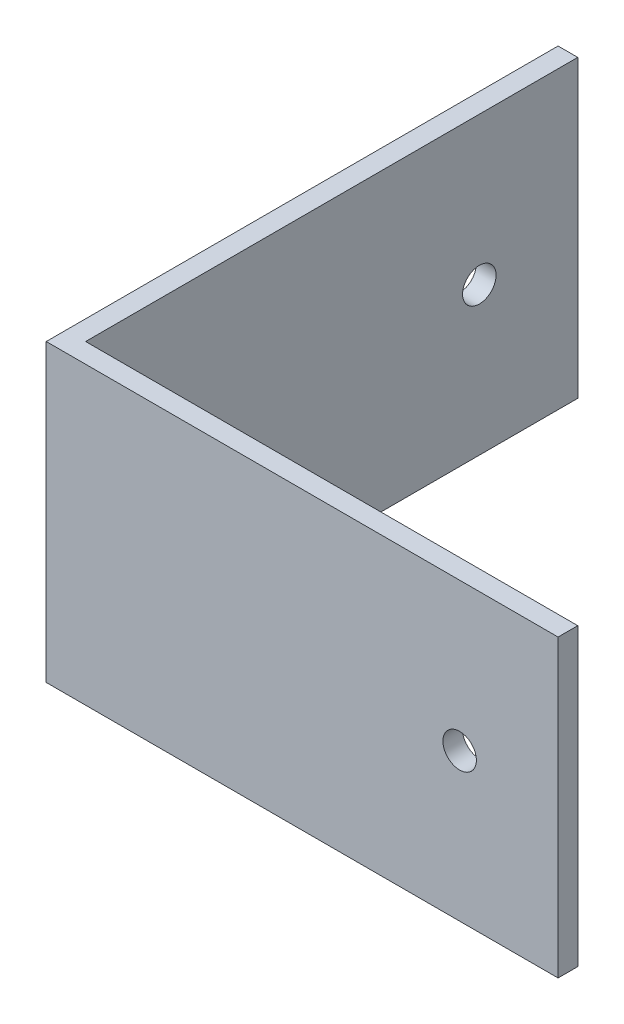
ISO-10303-21;
HEADER;
FILE_DESCRIPTION(('STEP AP214'),'2;1');
FILE_NAME('part.step','',(''),(''),'','','');
FILE_SCHEMA(('AUTOMOTIVE_DESIGN { 1 0 10303 214 1 1 1 1 }'));
ENDSEC;
DATA;
#1=APPLICATION_CONTEXT('core data for automotive mechanical design processes');
#2=APPLICATION_PROTOCOL_DEFINITION('international standard','automotive_design',2000,#1);
#3=PRODUCT_CONTEXT('',#1,'mechanical');
#4=PRODUCT('Part','Part','',(#3));
#5=PRODUCT_RELATED_PRODUCT_CATEGORY('part','',(#4));
#6=PRODUCT_DEFINITION_FORMATION('','',#4);
#7=PRODUCT_DEFINITION_CONTEXT('part definition',#1,'design');
#8=PRODUCT_DEFINITION('design','',#6,#7);
#9=PRODUCT_DEFINITION_SHAPE('','',#8);
#10=(LENGTH_UNIT() NAMED_UNIT(*) SI_UNIT(.MILLI.,.METRE.));
#11=(NAMED_UNIT(*) PLANE_ANGLE_UNIT() SI_UNIT($,.RADIAN.));
#12=(NAMED_UNIT(*) SI_UNIT($,.STERADIAN.) SOLID_ANGLE_UNIT());
#13=UNCERTAINTY_MEASURE_WITH_UNIT(LENGTH_MEASURE(1.E-05),#10,'distance_accuracy_value','');
#14=(GEOMETRIC_REPRESENTATION_CONTEXT(3) GLOBAL_UNCERTAINTY_ASSIGNED_CONTEXT((#13)) GLOBAL_UNIT_ASSIGNED_CONTEXT((#10,
#11,#12)) REPRESENTATION_CONTEXT('',''));
#15=CARTESIAN_POINT('',(0.,0.,0.));
#16=DIRECTION('',(0.,0.,1.));
#17=DIRECTION('',(1.,0.,0.));
#18=AXIS2_PLACEMENT_3D('',#15,#16,#17);
#19=CARTESIAN_POINT('',(0.,0.,1.));
#20=DIRECTION('',(0.,0.,1.));
#21=DIRECTION('',(1.,0.,0.));
#22=AXIS2_PLACEMENT_3D('',#19,#20,#21);
#23=PLANE('',#22);
#24=DIRECTION('',(0.,1.,0.));
#25=VECTOR('',#24,1.);
#26=CARTESIAN_POINT('',(12.5,7.5,1.));
#27=LINE('',#26,#25);
#28=CARTESIAN_POINT('',(12.5,-7.5,1.));
#29=VERTEX_POINT('',#28);
#30=CARTESIAN_POINT('',(12.5,7.5,1.));
#31=VERTEX_POINT('',#30);
#32=EDGE_CURVE('E87',#29,#31,#27,.T.);
#33=ORIENTED_EDGE('',*,*,#32,.T.);
#34=DIRECTION('',(-1.,0.,0.));
#35=VECTOR('',#34,1.);
#36=CARTESIAN_POINT('',(-12.5,7.5,1.));
#37=LINE('',#36,#35);
#38=CARTESIAN_POINT('',(-13.5,7.5,1.));
#39=VERTEX_POINT('',#38);
#40=EDGE_CURVE('E132',#31,#39,#37,.T.);
#41=ORIENTED_EDGE('',*,*,#40,.T.);
#42=DIRECTION('',(0.,1.,0.));
#43=VECTOR('',#42,1.);
#44=CARTESIAN_POINT('',(-13.5,7.5,1.));
#45=LINE('',#44,#43);
#46=CARTESIAN_POINT('',(-13.5,-7.5,1.));
#47=VERTEX_POINT('',#46);
#48=EDGE_CURVE('E136',#47,#39,#45,.T.);
#49=ORIENTED_EDGE('',*,*,#48,.F.);
#50=DIRECTION('',(1.,0.,0.));
#51=VECTOR('',#50,1.);
#52=CARTESIAN_POINT('',(-12.5,-7.5,1.));
#53=LINE('',#52,#51);
#54=EDGE_CURVE('E57',#47,#29,#53,.T.);
#55=ORIENTED_EDGE('',*,*,#54,.T.);
#56=EDGE_LOOP('',(#33,#41,#49,#55));
#57=FACE_BOUND('',#56,.T.);
#58=CARTESIAN_POINT('',(7.5,0.,1.));
#59=DIRECTION('',(0.,0.,1.));
#60=DIRECTION('',(1.,0.,0.));
#61=AXIS2_PLACEMENT_3D('',#58,#59,#60);
#62=CIRCLE('',#61,0.849999999999998);
#63=CARTESIAN_POINT('',(8.35,0.,1.));
#64=VERTEX_POINT('',#63);
#65=EDGE_CURVE('E98',#64,#64,#62,.T.);
#66=ORIENTED_EDGE('',*,*,#65,.F.);
#67=EDGE_LOOP('',(#66));
#68=FACE_BOUND('',#67,.T.);
#69=ADVANCED_FACE('F39',(#57,#68),#23,.T.);
#70=CARTESIAN_POINT('',(0.,0.,0.));
#71=DIRECTION('',(0.,0.,1.));
#72=DIRECTION('',(1.,0.,0.));
#73=AXIS2_PLACEMENT_3D('',#70,#71,#72);
#74=PLANE('',#73);
#75=DIRECTION('',(0.,1.,0.));
#76=VECTOR('',#75,1.);
#77=CARTESIAN_POINT('',(12.5,7.5,0.));
#78=LINE('',#77,#76);
#79=CARTESIAN_POINT('',(12.5,-7.5,0.));
#80=VERTEX_POINT('',#79);
#81=CARTESIAN_POINT('',(12.5,7.5,0.));
#82=VERTEX_POINT('',#81);
#83=EDGE_CURVE('E93',#80,#82,#78,.T.);
#84=ORIENTED_EDGE('',*,*,#83,.F.);
#85=DIRECTION('',(1.,0.,0.));
#86=VECTOR('',#85,1.);
#87=CARTESIAN_POINT('',(-12.5,-7.5,0.));
#88=LINE('',#87,#86);
#89=CARTESIAN_POINT('',(-12.5,-7.5,0.));
#90=VERTEX_POINT('',#89);
#91=EDGE_CURVE('E76',#90,#80,#88,.T.);
#92=ORIENTED_EDGE('',*,*,#91,.F.);
#93=DIRECTION('',(0.,-1.,0.));
#94=VECTOR('',#93,1.);
#95=CARTESIAN_POINT('',(-12.5,7.5,0.));
#96=LINE('',#95,#94);
#97=CARTESIAN_POINT('',(-12.5,7.5,0.));
#98=VERTEX_POINT('',#97);
#99=EDGE_CURVE('E88',#98,#90,#96,.T.);
#100=ORIENTED_EDGE('',*,*,#99,.F.);
#101=DIRECTION('',(-1.,0.,0.));
#102=VECTOR('',#101,1.);
#103=CARTESIAN_POINT('',(-12.5,7.5,0.));
#104=LINE('',#103,#102);
#105=EDGE_CURVE('E70',#82,#98,#104,.T.);
#106=ORIENTED_EDGE('',*,*,#105,.F.);
#107=EDGE_LOOP('',(#84,#92,#100,#106));
#108=FACE_BOUND('',#107,.T.);
#109=CARTESIAN_POINT('',(7.5,0.,0.));
#110=DIRECTION('',(0.,0.,1.));
#111=DIRECTION('',(1.,0.,0.));
#112=AXIS2_PLACEMENT_3D('',#109,#110,#111);
#113=CIRCLE('',#112,0.849999999999998);
#114=CARTESIAN_POINT('',(8.35,0.,0.));
#115=VERTEX_POINT('',#114);
#116=EDGE_CURVE('E104',#115,#115,#113,.T.);
#117=ORIENTED_EDGE('',*,*,#116,.T.);
#118=EDGE_LOOP('',(#117));
#119=FACE_BOUND('',#118,.T.);
#120=ADVANCED_FACE('F95',(#108,#119),#74,.F.);
#121=CARTESIAN_POINT('',(12.5,7.5,1.));
#122=DIRECTION('',(-1.,0.,0.));
#123=DIRECTION('',(0.,0.,1.));
#124=AXIS2_PLACEMENT_3D('',#121,#122,#123);
#125=PLANE('',#124);
#126=ORIENTED_EDGE('',*,*,#83,.T.);
#127=DIRECTION('',(0.,0.,-1.));
#128=VECTOR('',#127,1.);
#129=CARTESIAN_POINT('',(12.5,7.5,1.));
#130=LINE('',#129,#128);
#131=EDGE_CURVE('E11',#31,#82,#130,.T.);
#132=ORIENTED_EDGE('',*,*,#131,.F.);
#133=ORIENTED_EDGE('',*,*,#32,.F.);
#134=DIRECTION('',(0.,0.,-1.));
#135=VECTOR('',#134,1.);
#136=CARTESIAN_POINT('',(12.5,-7.5,1.));
#137=LINE('',#136,#135);
#138=EDGE_CURVE('E49',#29,#80,#137,.T.);
#139=ORIENTED_EDGE('',*,*,#138,.T.);
#140=EDGE_LOOP('',(#126,#132,#133,#139));
#141=FACE_BOUND('',#140,.T.);
#142=ADVANCED_FACE('F41',(#141),#125,.F.);
#143=CARTESIAN_POINT('',(-12.5,7.5,1.));
#144=DIRECTION('',(0.,-1.,0.));
#145=DIRECTION('',(0.,0.,-1.));
#146=AXIS2_PLACEMENT_3D('',#143,#144,#145);
#147=PLANE('',#146);
#148=ORIENTED_EDGE('',*,*,#105,.T.);
#149=DIRECTION('',(0.,0.,-1.));
#150=VECTOR('',#149,1.);
#151=CARTESIAN_POINT('',(-12.5,7.5,1.));
#152=LINE('',#151,#150);
#153=CARTESIAN_POINT('',(-12.5,7.5,-25.));
#154=VERTEX_POINT('',#153);
#155=EDGE_CURVE('E116',#98,#154,#152,.T.);
#156=ORIENTED_EDGE('',*,*,#155,.T.);
#157=DIRECTION('',(1.,0.,0.));
#158=VECTOR('',#157,1.);
#159=CARTESIAN_POINT('',(-13.5,7.5,-25.));
#160=LINE('',#159,#158);
#161=CARTESIAN_POINT('',(-13.5,7.5,-25.));
#162=VERTEX_POINT('',#161);
#163=EDGE_CURVE('E142',#162,#154,#160,.T.);
#164=ORIENTED_EDGE('',*,*,#163,.F.);
#165=DIRECTION('',(0.,0.,-1.));
#166=VECTOR('',#165,1.);
#167=CARTESIAN_POINT('',(-13.5,7.5,1.));
#168=LINE('',#167,#166);
#169=EDGE_CURVE('E139',#39,#162,#168,.T.);
#170=ORIENTED_EDGE('',*,*,#169,.F.);
#171=ORIENTED_EDGE('',*,*,#40,.F.);
#172=ORIENTED_EDGE('',*,*,#131,.T.);
#173=EDGE_LOOP('',(#148,#156,#164,#170,#171,#172));
#174=FACE_BOUND('',#173,.T.);
#175=ADVANCED_FACE('F140',(#174),#147,.F.);
#176=CARTESIAN_POINT('',(-12.5,-7.5,1.));
#177=DIRECTION('',(0.,1.,0.));
#178=DIRECTION('',(0.,0.,1.));
#179=AXIS2_PLACEMENT_3D('',#176,#177,#178);
#180=PLANE('',#179);
#181=ORIENTED_EDGE('',*,*,#91,.T.);
#182=ORIENTED_EDGE('',*,*,#138,.F.);
#183=ORIENTED_EDGE('',*,*,#54,.F.);
#184=DIRECTION('',(0.,0.,1.));
#185=VECTOR('',#184,1.);
#186=CARTESIAN_POINT('',(-13.5,-7.5,1.));
#187=LINE('',#186,#185);
#188=CARTESIAN_POINT('',(-13.5,-7.5,-25.));
#189=VERTEX_POINT('',#188);
#190=EDGE_CURVE('E152',#189,#47,#187,.T.);
#191=ORIENTED_EDGE('',*,*,#190,.F.);
#192=DIRECTION('',(1.,0.,0.));
#193=VECTOR('',#192,1.);
#194=CARTESIAN_POINT('',(-13.5,-7.5,-25.));
#195=LINE('',#194,#193);
#196=CARTESIAN_POINT('',(-12.5,-7.5,-25.));
#197=VERTEX_POINT('',#196);
#198=EDGE_CURVE('E166',#189,#197,#195,.T.);
#199=ORIENTED_EDGE('',*,*,#198,.T.);
#200=DIRECTION('',(0.,0.,1.));
#201=VECTOR('',#200,1.);
#202=CARTESIAN_POINT('',(-12.5,-7.5,1.));
#203=LINE('',#202,#201);
#204=EDGE_CURVE('E82',#197,#90,#203,.T.);
#205=ORIENTED_EDGE('',*,*,#204,.T.);
#206=EDGE_LOOP('',(#181,#182,#183,#191,#199,#205));
#207=FACE_BOUND('',#206,.T.);
#208=ADVANCED_FACE('F78',(#207),#180,.F.);
#209=CARTESIAN_POINT('',(7.5,0.,1.));
#210=DIRECTION('',(0.,0.,-1.));
#211=DIRECTION('',(-1.,0.,0.));
#212=AXIS2_PLACEMENT_3D('',#209,#210,#211);
#213=CYLINDRICAL_SURFACE('',#212,0.849999999999998);
#214=ORIENTED_EDGE('',*,*,#65,.T.);
#215=EDGE_LOOP('',(#214));
#216=FACE_BOUND('',#215,.T.);
#217=ORIENTED_EDGE('',*,*,#116,.F.);
#218=EDGE_LOOP('',(#217));
#219=FACE_BOUND('',#218,.T.);
#220=ADVANCED_FACE('F183',(#216,#219),#213,.F.);
#221=CARTESIAN_POINT('',(-13.5,0.,0.));
#222=DIRECTION('',(1.,0.,0.));
#223=DIRECTION('',(0.,0.,-1.));
#224=AXIS2_PLACEMENT_3D('',#221,#222,#223);
#225=PLANE('',#224);
#226=ORIENTED_EDGE('',*,*,#48,.T.);
#227=ORIENTED_EDGE('',*,*,#169,.T.);
#228=DIRECTION('',(0.,-1.,0.));
#229=VECTOR('',#228,1.);
#230=CARTESIAN_POINT('',(-13.5,7.5,-25.));
#231=LINE('',#230,#229);
#232=EDGE_CURVE('E146',#162,#189,#231,.T.);
#233=ORIENTED_EDGE('',*,*,#232,.T.);
#234=ORIENTED_EDGE('',*,*,#190,.T.);
#235=EDGE_LOOP('',(#226,#227,#233,#234));
#236=FACE_BOUND('',#235,.T.);
#237=CARTESIAN_POINT('',(-13.5,0.,-20.));
#238=DIRECTION('',(-1.,0.,0.));
#239=DIRECTION('',(0.,0.,1.));
#240=AXIS2_PLACEMENT_3D('',#237,#238,#239);
#241=CIRCLE('',#240,0.85);
#242=CARTESIAN_POINT('',(-13.5,0.,-19.15));
#243=VERTEX_POINT('',#242);
#244=EDGE_CURVE('E169',#243,#243,#241,.T.);
#245=ORIENTED_EDGE('',*,*,#244,.F.);
#246=EDGE_LOOP('',(#245));
#247=FACE_BOUND('',#246,.T.);
#248=ADVANCED_FACE('F149',(#236,#247),#225,.F.);
#249=CARTESIAN_POINT('',(-12.5,0.,0.));
#250=DIRECTION('',(1.,0.,0.));
#251=DIRECTION('',(0.,0.,-1.));
#252=AXIS2_PLACEMENT_3D('',#249,#250,#251);
#253=PLANE('',#252);
#254=ORIENTED_EDGE('',*,*,#155,.F.);
#255=ORIENTED_EDGE('',*,*,#99,.T.);
#256=ORIENTED_EDGE('',*,*,#204,.F.);
#257=DIRECTION('',(0.,-1.,0.));
#258=VECTOR('',#257,1.);
#259=CARTESIAN_POINT('',(-12.5,7.5,-25.));
#260=LINE('',#259,#258);
#261=EDGE_CURVE('E156',#154,#197,#260,.T.);
#262=ORIENTED_EDGE('',*,*,#261,.F.);
#263=EDGE_LOOP('',(#254,#255,#256,#262));
#264=FACE_BOUND('',#263,.T.);
#265=CARTESIAN_POINT('',(-12.5,0.,-20.));
#266=DIRECTION('',(-1.,0.,0.));
#267=DIRECTION('',(0.,0.,1.));
#268=AXIS2_PLACEMENT_3D('',#265,#266,#267);
#269=CIRCLE('',#268,0.85);
#270=CARTESIAN_POINT('',(-12.5,0.,-19.15));
#271=VERTEX_POINT('',#270);
#272=EDGE_CURVE('E159',#271,#271,#269,.T.);
#273=ORIENTED_EDGE('',*,*,#272,.T.);
#274=EDGE_LOOP('',(#273));
#275=FACE_BOUND('',#274,.T.);
#276=ADVANCED_FACE('F112',(#264,#275),#253,.T.);
#277=CARTESIAN_POINT('',(-13.5,7.5,-25.));
#278=DIRECTION('',(0.,0.,1.));
#279=DIRECTION('',(0.,-1.,0.));
#280=AXIS2_PLACEMENT_3D('',#277,#278,#279);
#281=PLANE('',#280);
#282=ORIENTED_EDGE('',*,*,#261,.T.);
#283=ORIENTED_EDGE('',*,*,#198,.F.);
#284=ORIENTED_EDGE('',*,*,#232,.F.);
#285=ORIENTED_EDGE('',*,*,#163,.T.);
#286=EDGE_LOOP('',(#282,#283,#284,#285));
#287=FACE_BOUND('',#286,.T.);
#288=ADVANCED_FACE('F240',(#287),#281,.F.);
#289=CARTESIAN_POINT('',(-13.5,0.,-20.));
#290=DIRECTION('',(1.,0.,0.));
#291=DIRECTION('',(0.,0.,-1.));
#292=AXIS2_PLACEMENT_3D('',#289,#290,#291);
#293=CYLINDRICAL_SURFACE('',#292,0.85);
#294=ORIENTED_EDGE('',*,*,#244,.T.);
#295=EDGE_LOOP('',(#294));
#296=FACE_BOUND('',#295,.T.);
#297=ORIENTED_EDGE('',*,*,#272,.F.);
#298=EDGE_LOOP('',(#297));
#299=FACE_BOUND('',#298,.T.);
#300=ADVANCED_FACE('F249',(#296,#299),#293,.F.);
#301=CLOSED_SHELL('',(#69,#120,#142,#175,#208,#220,#248,#276,#288,#300));
#302=MANIFOLD_SOLID_BREP('B2',#301);
#303=ADVANCED_BREP_SHAPE_REPRESENTATION('',(#18,#302),#14);
#304=SHAPE_DEFINITION_REPRESENTATION(#9,#303);
ENDSEC;
END-ISO-10303-21;
